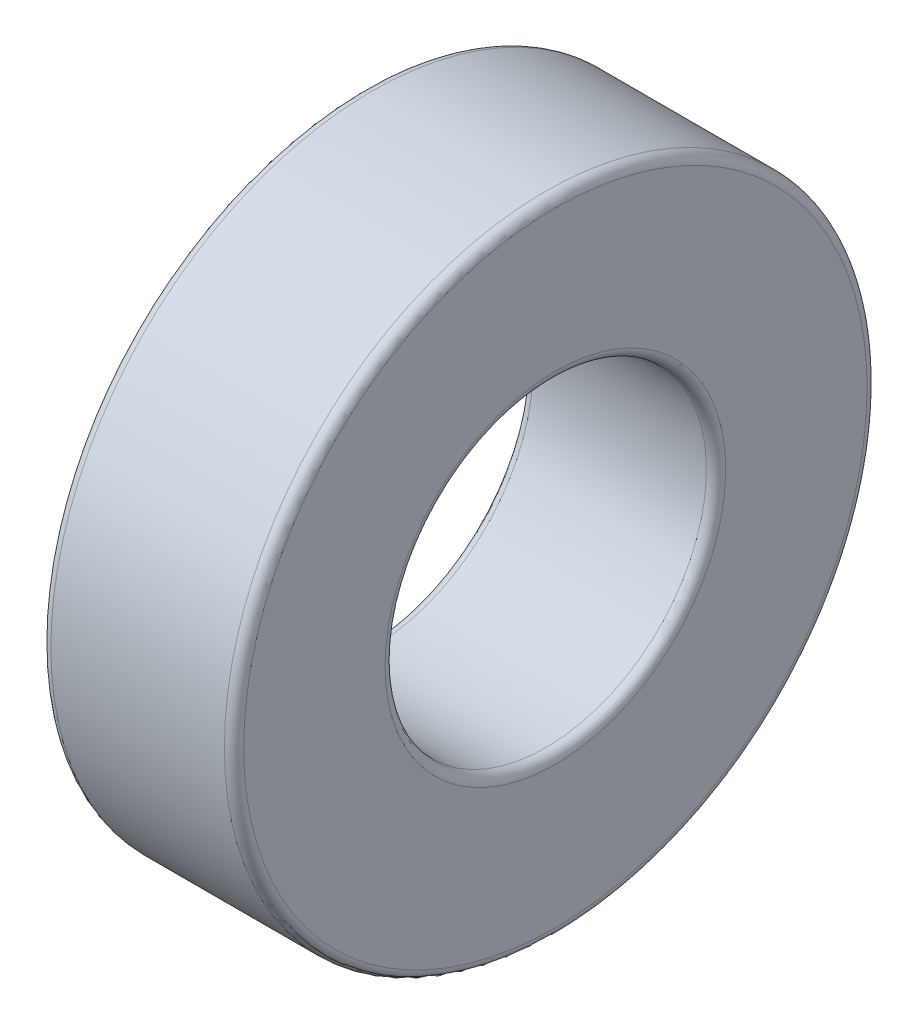
ISO-10303-21;
HEADER;
FILE_DESCRIPTION(('STEP AP214'),'2;1');
FILE_NAME('part.step','',(''),(''),'','','');
FILE_SCHEMA(('AUTOMOTIVE_DESIGN { 1 0 10303 214 1 1 1 1 }'));
ENDSEC;
DATA;
#1=APPLICATION_CONTEXT('core data for automotive mechanical design processes');
#2=APPLICATION_PROTOCOL_DEFINITION('international standard','automotive_design',2000,#1);
#3=PRODUCT_CONTEXT('',#1,'mechanical');
#4=PRODUCT('Part','Part','',(#3));
#5=PRODUCT_RELATED_PRODUCT_CATEGORY('part','',(#4));
#6=PRODUCT_DEFINITION_FORMATION('','',#4);
#7=PRODUCT_DEFINITION_CONTEXT('part definition',#1,'design');
#8=PRODUCT_DEFINITION('design','',#6,#7);
#9=PRODUCT_DEFINITION_SHAPE('','',#8);
#10=(LENGTH_UNIT() NAMED_UNIT(*) SI_UNIT(.MILLI.,.METRE.));
#11=(NAMED_UNIT(*) PLANE_ANGLE_UNIT() SI_UNIT($,.RADIAN.));
#12=(NAMED_UNIT(*) SI_UNIT($,.STERADIAN.) SOLID_ANGLE_UNIT());
#13=UNCERTAINTY_MEASURE_WITH_UNIT(LENGTH_MEASURE(1.E-05),#10,'distance_accuracy_value','');
#14=(GEOMETRIC_REPRESENTATION_CONTEXT(3) GLOBAL_UNCERTAINTY_ASSIGNED_CONTEXT((#13)) GLOBAL_UNIT_ASSIGNED_CONTEXT((#10,
#11,#12)) REPRESENTATION_CONTEXT('',''));
#15=CARTESIAN_POINT('',(0.,0.,0.));
#16=DIRECTION('',(0.,0.,1.));
#17=DIRECTION('',(1.,0.,0.));
#18=AXIS2_PLACEMENT_3D('',#15,#16,#17);
#19=CARTESIAN_POINT('',(0.15,0.,0.));
#20=DIRECTION('',(-1.,0.,0.));
#21=DIRECTION('',(0.,0.,1.));
#22=AXIS2_PLACEMENT_3D('',#19,#20,#21);
#23=CYLINDRICAL_SURFACE('',#22,2.5);
#24=CARTESIAN_POINT('',(2.85,0.,0.));
#25=DIRECTION('',(-1.,0.,0.));
#26=DIRECTION('',(0.,0.,1.));
#27=AXIS2_PLACEMENT_3D('',#24,#25,#26);
#28=CIRCLE('',#27,2.5);
#29=CARTESIAN_POINT('',(2.85,0.,2.5));
#30=VERTEX_POINT('',#29);
#31=EDGE_CURVE('E10',#30,#30,#28,.T.);
#32=ORIENTED_EDGE('',*,*,#31,.F.);
#33=EDGE_LOOP('',(#32));
#34=FACE_BOUND('',#33,.T.);
#35=CARTESIAN_POINT('',(0.15,0.,0.));
#36=DIRECTION('',(-1.,0.,0.));
#37=DIRECTION('',(0.,0.,1.));
#38=AXIS2_PLACEMENT_3D('',#35,#36,#37);
#39=CIRCLE('',#38,2.5);
#40=CARTESIAN_POINT('',(0.15,0.,2.5));
#41=VERTEX_POINT('',#40);
#42=EDGE_CURVE('E83',#41,#41,#39,.T.);
#43=ORIENTED_EDGE('',*,*,#42,.T.);
#44=EDGE_LOOP('',(#43));
#45=FACE_BOUND('',#44,.T.);
#46=ADVANCED_FACE('F15',(#34,#45),#23,.F.);
#47=CARTESIAN_POINT('',(2.85,0.,0.));
#48=DIRECTION('',(-1.,0.,0.));
#49=DIRECTION('',(0.,0.,1.));
#50=AXIS2_PLACEMENT_3D('',#47,#48,#49);
#51=TOROIDAL_SURFACE('',#50,2.65,0.15);
#52=CARTESIAN_POINT('',(3.,0.,0.));
#53=DIRECTION('',(-1.,0.,0.));
#54=DIRECTION('',(0.,0.,1.));
#55=AXIS2_PLACEMENT_3D('',#52,#53,#54);
#56=CIRCLE('',#55,2.65);
#57=CARTESIAN_POINT('',(3.,0.,2.65));
#58=VERTEX_POINT('',#57);
#59=EDGE_CURVE('E24',#58,#58,#56,.T.);
#60=ORIENTED_EDGE('',*,*,#59,.F.);
#61=EDGE_LOOP('',(#60));
#62=FACE_BOUND('',#61,.T.);
#63=ORIENTED_EDGE('',*,*,#31,.T.);
#64=EDGE_LOOP('',(#63));
#65=FACE_BOUND('',#64,.T.);
#66=ADVANCED_FACE('F110',(#62,#65),#51,.T.);
#67=CARTESIAN_POINT('',(3.,2.65,0.));
#68=DIRECTION('',(-1.,0.,0.));
#69=DIRECTION('',(0.,0.,1.));
#70=AXIS2_PLACEMENT_3D('',#67,#68,#69);
#71=PLANE('',#70);
#72=CARTESIAN_POINT('',(3.,0.,0.));
#73=DIRECTION('',(-1.,0.,0.));
#74=DIRECTION('',(0.,0.,1.));
#75=AXIS2_PLACEMENT_3D('',#72,#73,#74);
#76=CIRCLE('',#75,4.85);
#77=CARTESIAN_POINT('',(3.,0.,4.85));
#78=VERTEX_POINT('',#77);
#79=EDGE_CURVE('E33',#78,#78,#76,.T.);
#80=ORIENTED_EDGE('',*,*,#79,.F.);
#81=EDGE_LOOP('',(#80));
#82=FACE_BOUND('',#81,.T.);
#83=ORIENTED_EDGE('',*,*,#59,.T.);
#84=EDGE_LOOP('',(#83));
#85=FACE_BOUND('',#84,.T.);
#86=ADVANCED_FACE('F107',(#82,#85),#71,.F.);
#87=CARTESIAN_POINT('',(2.85,0.,0.));
#88=DIRECTION('',(-1.,0.,0.));
#89=DIRECTION('',(0.,0.,1.));
#90=AXIS2_PLACEMENT_3D('',#87,#88,#89);
#91=TOROIDAL_SURFACE('',#90,4.85,0.15);
#92=CARTESIAN_POINT('',(2.85,0.,0.));
#93=DIRECTION('',(-1.,0.,0.));
#94=DIRECTION('',(0.,0.,1.));
#95=AXIS2_PLACEMENT_3D('',#92,#93,#94);
#96=CIRCLE('',#95,5.);
#97=CARTESIAN_POINT('',(2.85,0.,5.));
#98=VERTEX_POINT('',#97);
#99=EDGE_CURVE('E97',#98,#98,#96,.T.);
#100=ORIENTED_EDGE('',*,*,#99,.F.);
#101=EDGE_LOOP('',(#100));
#102=FACE_BOUND('',#101,.T.);
#103=ORIENTED_EDGE('',*,*,#79,.T.);
#104=EDGE_LOOP('',(#103));
#105=FACE_BOUND('',#104,.T.);
#106=ADVANCED_FACE('F105',(#102,#105),#91,.T.);
#107=CARTESIAN_POINT('',(0.15,0.,0.));
#108=DIRECTION('',(-1.,0.,0.));
#109=DIRECTION('',(0.,0.,1.));
#110=AXIS2_PLACEMENT_3D('',#107,#108,#109);
#111=CYLINDRICAL_SURFACE('',#110,5.);
#112=CARTESIAN_POINT('',(0.15,0.,0.));
#113=DIRECTION('',(-1.,0.,0.));
#114=DIRECTION('',(0.,0.,1.));
#115=AXIS2_PLACEMENT_3D('',#112,#113,#114);
#116=CIRCLE('',#115,5.);
#117=CARTESIAN_POINT('',(0.15,0.,5.));
#118=VERTEX_POINT('',#117);
#119=EDGE_CURVE('E93',#118,#118,#116,.T.);
#120=ORIENTED_EDGE('',*,*,#119,.F.);
#121=EDGE_LOOP('',(#120));
#122=FACE_BOUND('',#121,.T.);
#123=ORIENTED_EDGE('',*,*,#99,.T.);
#124=EDGE_LOOP('',(#123));
#125=FACE_BOUND('',#124,.T.);
#126=ADVANCED_FACE('F124',(#122,#125),#111,.T.);
#127=CARTESIAN_POINT('',(0.15,0.,0.));
#128=DIRECTION('',(-1.,0.,0.));
#129=DIRECTION('',(0.,0.,1.));
#130=AXIS2_PLACEMENT_3D('',#127,#128,#129);
#131=TOROIDAL_SURFACE('',#130,4.85,0.15);
#132=CARTESIAN_POINT('',(0.,0.,0.));
#133=DIRECTION('',(-1.,0.,0.));
#134=DIRECTION('',(0.,0.,1.));
#135=AXIS2_PLACEMENT_3D('',#132,#133,#134);
#136=CIRCLE('',#135,4.85);
#137=CARTESIAN_POINT('',(0.,0.,4.85));
#138=VERTEX_POINT('',#137);
#139=EDGE_CURVE('E90',#138,#138,#136,.T.);
#140=ORIENTED_EDGE('',*,*,#139,.F.);
#141=EDGE_LOOP('',(#140));
#142=FACE_BOUND('',#141,.T.);
#143=ORIENTED_EDGE('',*,*,#119,.T.);
#144=EDGE_LOOP('',(#143));
#145=FACE_BOUND('',#144,.T.);
#146=ADVANCED_FACE('F128',(#142,#145),#131,.T.);
#147=CARTESIAN_POINT('',(0.,2.65,0.));
#148=DIRECTION('',(-1.,0.,0.));
#149=DIRECTION('',(0.,0.,1.));
#150=AXIS2_PLACEMENT_3D('',#147,#148,#149);
#151=PLANE('',#150);
#152=ORIENTED_EDGE('',*,*,#139,.T.);
#153=EDGE_LOOP('',(#152));
#154=FACE_BOUND('',#153,.T.);
#155=CARTESIAN_POINT('',(0.,0.,0.));
#156=DIRECTION('',(-1.,0.,0.));
#157=DIRECTION('',(0.,0.,1.));
#158=AXIS2_PLACEMENT_3D('',#155,#156,#157);
#159=CIRCLE('',#158,2.65);
#160=CARTESIAN_POINT('',(0.,0.,2.65));
#161=VERTEX_POINT('',#160);
#162=EDGE_CURVE('E86',#161,#161,#159,.T.);
#163=ORIENTED_EDGE('',*,*,#162,.F.);
#164=EDGE_LOOP('',(#163));
#165=FACE_BOUND('',#164,.T.);
#166=ADVANCED_FACE('F132',(#154,#165),#151,.T.);
#167=CARTESIAN_POINT('',(0.15,0.,0.));
#168=DIRECTION('',(-1.,0.,0.));
#169=DIRECTION('',(0.,0.,1.));
#170=AXIS2_PLACEMENT_3D('',#167,#168,#169);
#171=TOROIDAL_SURFACE('',#170,2.65,0.15);
#172=ORIENTED_EDGE('',*,*,#42,.F.);
#173=EDGE_LOOP('',(#172));
#174=FACE_BOUND('',#173,.T.);
#175=ORIENTED_EDGE('',*,*,#162,.T.);
#176=EDGE_LOOP('',(#175));
#177=FACE_BOUND('',#176,.T.);
#178=ADVANCED_FACE('F136',(#174,#177),#171,.T.);
#179=CLOSED_SHELL('',(#46,#66,#86,#106,#126,#146,#166,#178));
#180=CARTESIAN_POINT('',(0.5625,0.,0.));
#181=DIRECTION('',(-1.,0.,0.));
#182=DIRECTION('',(0.,0.,-1.));
#183=AXIS2_PLACEMENT_3D('',#180,#181,#182);
#184=CYLINDRICAL_SURFACE('',#183,3.6825);
#185=CARTESIAN_POINT('',(1.4325,0.,0.));
#186=DIRECTION('',(-1.,0.,0.));
#187=DIRECTION('',(0.,-1.,0.));
#188=AXIS2_PLACEMENT_3D('',#185,#186,#187);
#189=CIRCLE('',#188,3.6825);
#190=CARTESIAN_POINT('',(1.4325,-3.6825,0.));
#191=VERTEX_POINT('',#190);
#192=EDGE_CURVE('E64',#191,#191,#189,.T.);
#193=ORIENTED_EDGE('',*,*,#192,.T.);
#194=EDGE_LOOP('',(#193));
#195=FACE_BOUND('',#194,.T.);
#196=CARTESIAN_POINT('',(0.5625,0.,0.));
#197=DIRECTION('',(-1.,0.,0.));
#198=DIRECTION('',(0.,0.,-1.));
#199=AXIS2_PLACEMENT_3D('',#196,#197,#198);
#200=CIRCLE('',#199,3.6825);
#201=CARTESIAN_POINT('',(0.5625,0.,-3.6825));
#202=VERTEX_POINT('',#201);
#203=EDGE_CURVE('E79',#202,#202,#200,.T.);
#204=ORIENTED_EDGE('',*,*,#203,.F.);
#205=EDGE_LOOP('',(#204));
#206=FACE_BOUND('',#205,.T.);
#207=ADVANCED_FACE('F147',(#195,#206),#184,.T.);
#208=CARTESIAN_POINT('',(0.5625,0.,0.));
#209=DIRECTION('',(-1.,0.,0.));
#210=DIRECTION('',(0.,0.,-1.));
#211=AXIS2_PLACEMENT_3D('',#208,#209,#210);
#212=CYLINDRICAL_SURFACE('',#211,3.8175);
#213=CARTESIAN_POINT('',(1.4325,0.,0.));
#214=DIRECTION('',(-1.,0.,0.));
#215=DIRECTION('',(0.,-1.,0.));
#216=AXIS2_PLACEMENT_3D('',#213,#214,#215);
#217=CIRCLE('',#216,3.8175);
#218=CARTESIAN_POINT('',(1.4325,-3.8175,0.));
#219=VERTEX_POINT('',#218);
#220=EDGE_CURVE('E18',#219,#219,#217,.F.);
#221=ORIENTED_EDGE('',*,*,#220,.T.);
#222=EDGE_LOOP('',(#221));
#223=FACE_BOUND('',#222,.T.);
#224=CARTESIAN_POINT('',(0.5625,0.,0.));
#225=DIRECTION('',(-1.,0.,0.));
#226=DIRECTION('',(0.,0.,-1.));
#227=AXIS2_PLACEMENT_3D('',#224,#225,#226);
#228=CIRCLE('',#227,3.8175);
#229=CARTESIAN_POINT('',(0.5625,0.,-3.8175));
#230=VERTEX_POINT('',#229);
#231=EDGE_CURVE('E75',#230,#230,#228,.T.);
#232=ORIENTED_EDGE('',*,*,#231,.T.);
#233=EDGE_LOOP('',(#232));
#234=FACE_BOUND('',#233,.T.);
#235=ADVANCED_FACE('F152',(#223,#234),#212,.F.);
#236=CARTESIAN_POINT('',(0.5625,-3.6825,0.));
#237=DIRECTION('',(-1.,0.,0.));
#238=DIRECTION('',(0.,0.,-1.));
#239=AXIS2_PLACEMENT_3D('',#236,#237,#238);
#240=PLANE('',#239);
#241=ORIENTED_EDGE('',*,*,#231,.F.);
#242=EDGE_LOOP('',(#241));
#243=FACE_BOUND('',#242,.T.);
#244=ORIENTED_EDGE('',*,*,#203,.T.);
#245=EDGE_LOOP('',(#244));
#246=FACE_BOUND('',#245,.T.);
#247=ADVANCED_FACE('F149',(#243,#246),#240,.F.);
#248=CARTESIAN_POINT('',(1.4325,-3.33333333333333,0.));
#249=DIRECTION('',(-1.,0.,0.));
#250=DIRECTION('',(0.,0.,-1.));
#251=AXIS2_PLACEMENT_3D('',#248,#249,#250);
#252=PLANE('',#251);
#253=CARTESIAN_POINT('',(1.4325,0.,0.));
#254=DIRECTION('',(-1.,0.,0.));
#255=DIRECTION('',(0.,0.,-1.));
#256=AXIS2_PLACEMENT_3D('',#253,#254,#255);
#257=CIRCLE('',#256,4.16666666666667);
#258=CARTESIAN_POINT('',(1.4325,0.,-4.16666666666667));
#259=VERTEX_POINT('',#258);
#260=EDGE_CURVE('E51',#259,#259,#257,.T.);
#261=ORIENTED_EDGE('',*,*,#260,.F.);
#262=EDGE_LOOP('',(#261));
#263=FACE_BOUND('',#262,.T.);
#264=ORIENTED_EDGE('',*,*,#220,.F.);
#265=EDGE_LOOP('',(#264));
#266=FACE_BOUND('',#265,.T.);
#267=ADVANCED_FACE('F151',(#263,#266),#252,.F.);
#268=CARTESIAN_POINT('',(1.4325,0.,0.));
#269=DIRECTION('',(-1.,0.,0.));
#270=DIRECTION('',(0.,0.,-1.));
#271=AXIS2_PLACEMENT_3D('',#268,#269,#270);
#272=CYLINDRICAL_SURFACE('',#271,4.16666666666667);
#273=CARTESIAN_POINT('',(1.5675,0.,0.));
#274=DIRECTION('',(-1.,0.,0.));
#275=DIRECTION('',(0.,0.,-1.));
#276=AXIS2_PLACEMENT_3D('',#273,#274,#275);
#277=CIRCLE('',#276,4.16666666666667);
#278=CARTESIAN_POINT('',(1.5675,0.,-4.16666666666667));
#279=VERTEX_POINT('',#278);
#280=EDGE_CURVE('E60',#279,#279,#277,.T.);
#281=ORIENTED_EDGE('',*,*,#280,.F.);
#282=EDGE_LOOP('',(#281));
#283=FACE_BOUND('',#282,.T.);
#284=ORIENTED_EDGE('',*,*,#260,.T.);
#285=EDGE_LOOP('',(#284));
#286=FACE_BOUND('',#285,.T.);
#287=ADVANCED_FACE('F168',(#283,#286),#272,.F.);
#288=CARTESIAN_POINT('',(1.5675,-4.16666666666667,0.));
#289=DIRECTION('',(1.,0.,0.));
#290=DIRECTION('',(0.,0.,1.));
#291=AXIS2_PLACEMENT_3D('',#288,#289,#290);
#292=PLANE('',#291);
#293=ORIENTED_EDGE('',*,*,#280,.T.);
#294=EDGE_LOOP('',(#293));
#295=FACE_BOUND('',#294,.T.);
#296=CARTESIAN_POINT('',(1.5675,0.,0.));
#297=DIRECTION('',(1.,0.,0.));
#298=DIRECTION('',(0.,1.,0.));
#299=AXIS2_PLACEMENT_3D('',#296,#297,#298);
#300=CIRCLE('',#299,3.8175);
#301=CARTESIAN_POINT('',(1.5675,3.8175,0.));
#302=VERTEX_POINT('',#301);
#303=EDGE_CURVE('E36',#302,#302,#300,.F.);
#304=ORIENTED_EDGE('',*,*,#303,.F.);
#305=EDGE_LOOP('',(#304));
#306=FACE_BOUND('',#305,.T.);
#307=ADVANCED_FACE('F167',(#295,#306),#292,.F.);
#308=CARTESIAN_POINT('',(1.4325,0.,0.));
#309=DIRECTION('',(-1.,0.,0.));
#310=DIRECTION('',(0.,0.,-1.));
#311=AXIS2_PLACEMENT_3D('',#308,#309,#310);
#312=CIRCLE('',#311,3.33333333333333);
#313=CARTESIAN_POINT('',(1.4325,0.,-3.33333333333333));
#314=VERTEX_POINT('',#313);
#315=EDGE_CURVE('E40',#314,#314,#312,.T.);
#316=ORIENTED_EDGE('',*,*,#315,.T.);
#317=EDGE_LOOP('',(#316));
#318=FACE_BOUND('',#317,.T.);
#319=ORIENTED_EDGE('',*,*,#192,.F.);
#320=EDGE_LOOP('',(#319));
#321=FACE_BOUND('',#320,.T.);
#322=ADVANCED_FACE('F164',(#318,#321),#252,.F.);
#323=CARTESIAN_POINT('',(1.5675,0.,0.));
#324=DIRECTION('',(-1.,0.,0.));
#325=DIRECTION('',(0.,0.,-1.));
#326=AXIS2_PLACEMENT_3D('',#323,#324,#325);
#327=CIRCLE('',#326,3.33333333333333);
#328=CARTESIAN_POINT('',(1.5675,0.,-3.33333333333333));
#329=VERTEX_POINT('',#328);
#330=EDGE_CURVE('E209',#329,#329,#327,.T.);
#331=ORIENTED_EDGE('',*,*,#330,.F.);
#332=EDGE_LOOP('',(#331));
#333=FACE_BOUND('',#332,.T.);
#334=CARTESIAN_POINT('',(1.5675,0.,0.));
#335=DIRECTION('',(1.,0.,0.));
#336=DIRECTION('',(0.,1.,0.));
#337=AXIS2_PLACEMENT_3D('',#334,#335,#336);
#338=CIRCLE('',#337,3.6825);
#339=CARTESIAN_POINT('',(1.5675,3.6825,0.));
#340=VERTEX_POINT('',#339);
#341=EDGE_CURVE('E39',#340,#340,#338,.T.);
#342=ORIENTED_EDGE('',*,*,#341,.F.);
#343=EDGE_LOOP('',(#342));
#344=FACE_BOUND('',#343,.T.);
#345=ADVANCED_FACE('F162',(#333,#344),#292,.F.);
#346=CARTESIAN_POINT('',(1.4325,0.,0.));
#347=DIRECTION('',(-1.,0.,0.));
#348=DIRECTION('',(0.,0.,-1.));
#349=AXIS2_PLACEMENT_3D('',#346,#347,#348);
#350=CYLINDRICAL_SURFACE('',#349,3.33333333333333);
#351=ORIENTED_EDGE('',*,*,#315,.F.);
#352=EDGE_LOOP('',(#351));
#353=FACE_BOUND('',#352,.T.);
#354=ORIENTED_EDGE('',*,*,#330,.T.);
#355=EDGE_LOOP('',(#354));
#356=FACE_BOUND('',#355,.T.);
#357=ADVANCED_FACE('F145',(#353,#356),#350,.T.);
#358=ORIENTED_EDGE('',*,*,#341,.T.);
#359=EDGE_LOOP('',(#358));
#360=FACE_BOUND('',#359,.T.);
#361=CARTESIAN_POINT('',(2.4375,0.,0.));
#362=DIRECTION('',(-1.,0.,0.));
#363=DIRECTION('',(0.,0.,-1.));
#364=AXIS2_PLACEMENT_3D('',#361,#362,#363);
#365=CIRCLE('',#364,3.6825);
#366=CARTESIAN_POINT('',(2.4375,0.,-3.6825));
#367=VERTEX_POINT('',#366);
#368=EDGE_CURVE('E67',#367,#367,#365,.T.);
#369=ORIENTED_EDGE('',*,*,#368,.T.);
#370=EDGE_LOOP('',(#369));
#371=FACE_BOUND('',#370,.T.);
#372=ADVANCED_FACE('F141',(#360,#371),#184,.T.);
#373=CARTESIAN_POINT('',(2.4375,-3.8175,0.));
#374=DIRECTION('',(1.,0.,0.));
#375=DIRECTION('',(0.,0.,1.));
#376=AXIS2_PLACEMENT_3D('',#373,#374,#375);
#377=PLANE('',#376);
#378=ORIENTED_EDGE('',*,*,#368,.F.);
#379=EDGE_LOOP('',(#378));
#380=FACE_BOUND('',#379,.T.);
#381=CARTESIAN_POINT('',(2.4375,0.,0.));
#382=DIRECTION('',(-1.,0.,0.));
#383=DIRECTION('',(0.,0.,-1.));
#384=AXIS2_PLACEMENT_3D('',#381,#382,#383);
#385=CIRCLE('',#384,3.8175);
#386=CARTESIAN_POINT('',(2.4375,0.,-3.8175));
#387=VERTEX_POINT('',#386);
#388=EDGE_CURVE('E71',#387,#387,#385,.T.);
#389=ORIENTED_EDGE('',*,*,#388,.T.);
#390=EDGE_LOOP('',(#389));
#391=FACE_BOUND('',#390,.T.);
#392=ADVANCED_FACE('F144',(#380,#391),#377,.F.);
#393=ORIENTED_EDGE('',*,*,#303,.T.);
#394=EDGE_LOOP('',(#393));
#395=FACE_BOUND('',#394,.T.);
#396=ORIENTED_EDGE('',*,*,#388,.F.);
#397=EDGE_LOOP('',(#396));
#398=FACE_BOUND('',#397,.T.);
#399=ADVANCED_FACE('F154',(#395,#398),#212,.F.);
#400=CLOSED_SHELL('',(#207,#235,#247,#267,#287,#307,#322,#345,#357,#372,#392,#399));
#401=ORIENTED_CLOSED_SHELL('',*,#400,.T.);
#402=BREP_WITH_VOIDS('B1',#179,(#401));
#403=ADVANCED_BREP_SHAPE_REPRESENTATION('',(#18,#402),#14);
#404=SHAPE_DEFINITION_REPRESENTATION(#9,#403);
ENDSEC;
END-ISO-10303-21;
